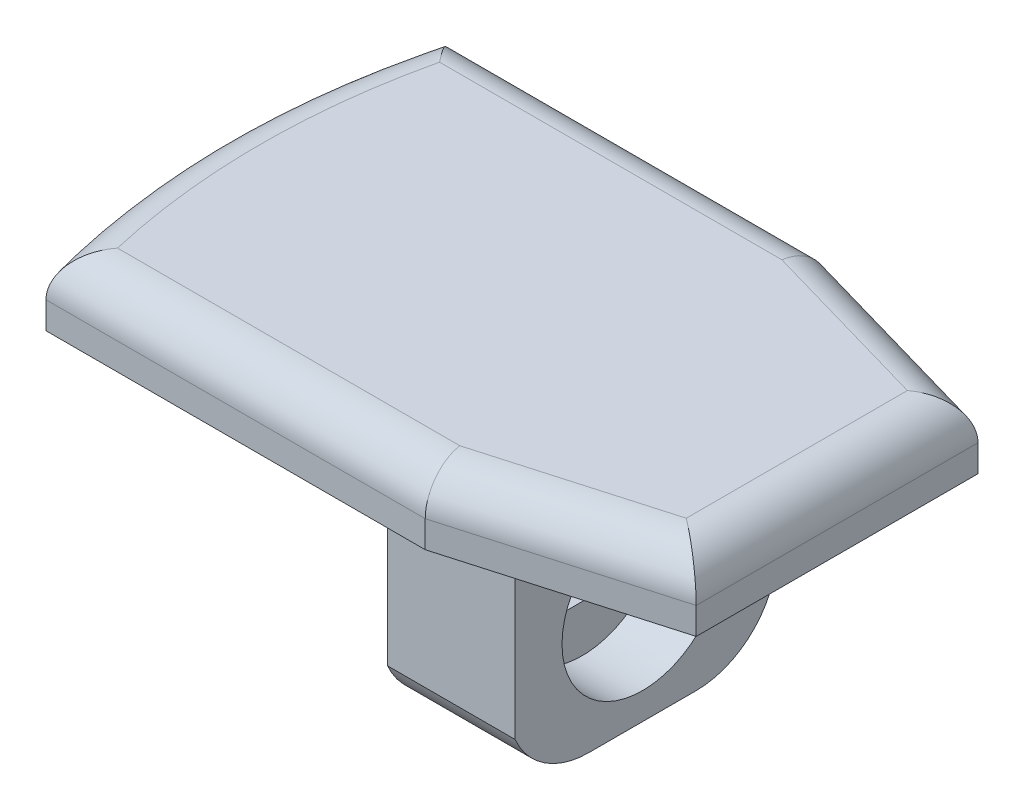
ISO-10303-21;
HEADER;
FILE_DESCRIPTION(('STEP AP214'),'2;1');
FILE_NAME('part.step','',(''),(''),'','','');
FILE_SCHEMA(('AUTOMOTIVE_DESIGN { 1 0 10303 214 1 1 1 1 }'));
ENDSEC;
DATA;
#1=APPLICATION_CONTEXT('core data for automotive mechanical design processes');
#2=APPLICATION_PROTOCOL_DEFINITION('international standard','automotive_design',2000,#1);
#3=PRODUCT_CONTEXT('',#1,'mechanical');
#4=PRODUCT('Part','Part','',(#3));
#5=PRODUCT_RELATED_PRODUCT_CATEGORY('part','',(#4));
#6=PRODUCT_DEFINITION_FORMATION('','',#4);
#7=PRODUCT_DEFINITION_CONTEXT('part definition',#1,'design');
#8=PRODUCT_DEFINITION('design','',#6,#7);
#9=PRODUCT_DEFINITION_SHAPE('','',#8);
#10=(LENGTH_UNIT() NAMED_UNIT(*) SI_UNIT(.MILLI.,.METRE.));
#11=(NAMED_UNIT(*) PLANE_ANGLE_UNIT() SI_UNIT($,.RADIAN.));
#12=(NAMED_UNIT(*) SI_UNIT($,.STERADIAN.) SOLID_ANGLE_UNIT());
#13=UNCERTAINTY_MEASURE_WITH_UNIT(LENGTH_MEASURE(1.E-05),#10,'distance_accuracy_value','');
#14=(GEOMETRIC_REPRESENTATION_CONTEXT(3) GLOBAL_UNCERTAINTY_ASSIGNED_CONTEXT((#13)) GLOBAL_UNIT_ASSIGNED_CONTEXT((#10,
#11,#12)) REPRESENTATION_CONTEXT('',''));
#15=CARTESIAN_POINT('',(0.,0.,0.));
#16=DIRECTION('',(0.,0.,1.));
#17=DIRECTION('',(1.,0.,0.));
#18=AXIS2_PLACEMENT_3D('',#15,#16,#17);
#19=CARTESIAN_POINT('',(0.,2.5,-50.6225865014302));
#20=DIRECTION('',(0.,0.,-1.));
#21=DIRECTION('',(-1.,0.,0.));
#22=AXIS2_PLACEMENT_3D('',#19,#20,#21);
#23=PLANE('',#22);
#24=DIRECTION('',(0.,-1.,0.));
#25=VECTOR('',#24,1.);
#26=CARTESIAN_POINT('',(-34.3395305183971,2.5,-50.6225865014302));
#27=LINE('',#26,#25);
#28=CARTESIAN_POINT('',(-34.3395305183971,1.,-50.6225865014302));
#29=VERTEX_POINT('',#28);
#30=CARTESIAN_POINT('',(-34.3395305183971,0.,-50.6225865014302));
#31=VERTEX_POINT('',#30);
#32=EDGE_CURVE('E288',#29,#31,#27,.T.);
#33=ORIENTED_EDGE('',*,*,#32,.F.);
#34=DIRECTION('',(1.,0.,0.));
#35=VECTOR('',#34,1.);
#36=CARTESIAN_POINT('',(0.,1.,-50.6225865014302));
#37=LINE('',#36,#35);
#38=CARTESIAN_POINT('',(-20.2093710966066,1.,-50.6225865014302));
#39=VERTEX_POINT('',#38);
#40=EDGE_CURVE('E314',#29,#39,#37,.T.);
#41=ORIENTED_EDGE('',*,*,#40,.T.);
#42=DIRECTION('',(0.,-1.,0.));
#43=VECTOR('',#42,1.);
#44=CARTESIAN_POINT('',(-20.2093710966066,2.5,-50.6225865014302));
#45=LINE('',#44,#43);
#46=CARTESIAN_POINT('',(-20.2093710966066,0.,-50.6225865014302));
#47=VERTEX_POINT('',#46);
#48=EDGE_CURVE('E278',#39,#47,#45,.T.);
#49=ORIENTED_EDGE('',*,*,#48,.T.);
#50=DIRECTION('',(1.,0.,0.));
#51=VECTOR('',#50,1.);
#52=CARTESIAN_POINT('',(0.,0.,-50.6225865014302));
#53=LINE('',#52,#51);
#54=EDGE_CURVE('E259',#31,#47,#53,.T.);
#55=ORIENTED_EDGE('',*,*,#54,.F.);
#56=EDGE_LOOP('',(#33,#41,#49,#55));
#57=FACE_BOUND('',#56,.T.);
#58=ADVANCED_FACE('F34',(#57),#23,.T.);
#59=CARTESIAN_POINT('',(-7.36268859796463,2.5,-43.1225865014302));
#60=DIRECTION('',(0.,-1.,0.));
#61=DIRECTION('',(0.,0.,-1.));
#62=AXIS2_PLACEMENT_3D('',#59,#60,#61);
#63=CYLINDRICAL_SURFACE('',#62,28.);
#64=DIRECTION('',(0.,-1.,0.));
#65=VECTOR('',#64,1.);
#66=CARTESIAN_POINT('',(-34.3395305183971,2.5,-35.6225865014302));
#67=LINE('',#66,#65);
#68=CARTESIAN_POINT('',(-34.3395305183971,1.,-35.6225865014302));
#69=VERTEX_POINT('',#68);
#70=CARTESIAN_POINT('',(-34.3395305183971,0.,-35.6225865014302));
#71=VERTEX_POINT('',#70);
#72=EDGE_CURVE('E286',#69,#71,#67,.T.);
#73=ORIENTED_EDGE('',*,*,#72,.F.);
#74=CARTESIAN_POINT('',(-7.36268859796463,1.,-43.1225865014302));
#75=DIRECTION('',(0.,1.,0.));
#76=DIRECTION('',(0.,0.,1.));
#77=AXIS2_PLACEMENT_3D('',#74,#75,#76);
#78=CIRCLE('',#77,28.);
#79=EDGE_CURVE('E312',#69,#29,#78,.F.);
#80=ORIENTED_EDGE('',*,*,#79,.T.);
#81=ORIENTED_EDGE('',*,*,#32,.T.);
#82=CARTESIAN_POINT('',(-7.36268859796463,0.,-43.1225865014302));
#83=DIRECTION('',(0.,1.,0.));
#84=DIRECTION('',(0.,0.,1.));
#85=AXIS2_PLACEMENT_3D('',#82,#83,#84);
#86=CIRCLE('',#85,28.);
#87=EDGE_CURVE('E262',#31,#71,#86,.T.);
#88=ORIENTED_EDGE('',*,*,#87,.T.);
#89=EDGE_LOOP('',(#73,#80,#81,#88));
#90=FACE_BOUND('',#89,.T.);
#91=ADVANCED_FACE('F370',(#90),#63,.T.);
#92=CARTESIAN_POINT('',(0.,2.5,-35.6225865014302));
#93=DIRECTION('',(0.,0.,1.));
#94=DIRECTION('',(1.,0.,0.));
#95=AXIS2_PLACEMENT_3D('',#92,#93,#94);
#96=PLANE('',#95);
#97=DIRECTION('',(0.,-1.,0.));
#98=VECTOR('',#97,1.);
#99=CARTESIAN_POINT('',(-20.2093710966067,2.5,-35.6225865014302));
#100=LINE('',#99,#98);
#101=CARTESIAN_POINT('',(-20.2093710966067,1.,-35.6225865014302));
#102=VERTEX_POINT('',#101);
#103=CARTESIAN_POINT('',(-20.2093710966067,0.,-35.6225865014302));
#104=VERTEX_POINT('',#103);
#105=EDGE_CURVE('E284',#102,#104,#100,.T.);
#106=ORIENTED_EDGE('',*,*,#105,.F.);
#107=DIRECTION('',(-1.,0.,0.));
#108=VECTOR('',#107,1.);
#109=CARTESIAN_POINT('',(0.,1.,-35.6225865014302));
#110=LINE('',#109,#108);
#111=EDGE_CURVE('E310',#102,#69,#110,.T.);
#112=ORIENTED_EDGE('',*,*,#111,.T.);
#113=ORIENTED_EDGE('',*,*,#72,.T.);
#114=DIRECTION('',(-1.,0.,0.));
#115=VECTOR('',#114,1.);
#116=CARTESIAN_POINT('',(0.,0.,-35.6225865014302));
#117=LINE('',#116,#115);
#118=EDGE_CURVE('E266',#104,#71,#117,.T.);
#119=ORIENTED_EDGE('',*,*,#118,.F.);
#120=EDGE_LOOP('',(#106,#112,#113,#119));
#121=FACE_BOUND('',#120,.T.);
#122=ADVANCED_FACE('F376',(#121),#96,.T.);
#123=CARTESIAN_POINT('',(-10.9739736212662,2.5,-38.2707941131326));
#124=DIRECTION('',(0.275637355817,0.,0.961261695938319));
#125=DIRECTION('',(0.961261695938319,0.,-0.275637355817));
#126=AXIS2_PLACEMENT_3D('',#123,#124,#125);
#127=PLANE('',#126);
#128=DIRECTION('',(0.,-1.,0.));
#129=VECTOR('',#128,1.);
#130=CARTESIAN_POINT('',(-12.3626885979646,2.5,-37.8725865014302));
#131=LINE('',#130,#129);
#132=CARTESIAN_POINT('',(-12.3626885979646,1.,-37.8725865014302));
#133=VERTEX_POINT('',#132);
#134=CARTESIAN_POINT('',(-12.3626885979646,0.,-37.8725865014302));
#135=VERTEX_POINT('',#134);
#136=EDGE_CURVE('E282',#133,#135,#131,.T.);
#137=ORIENTED_EDGE('',*,*,#136,.F.);
#138=DIRECTION('',(-0.961261695938319,0.,0.275637355817));
#139=VECTOR('',#138,1.);
#140=CARTESIAN_POINT('',(-10.9739736212662,1.,-38.2707941131326));
#141=LINE('',#140,#139);
#142=EDGE_CURVE('E308',#133,#102,#141,.T.);
#143=ORIENTED_EDGE('',*,*,#142,.T.);
#144=ORIENTED_EDGE('',*,*,#105,.T.);
#145=DIRECTION('',(-0.961261695938319,0.,0.275637355817));
#146=VECTOR('',#145,1.);
#147=CARTESIAN_POINT('',(-10.9739736212662,0.,-38.2707941131326));
#148=LINE('',#147,#146);
#149=EDGE_CURVE('E269',#135,#104,#148,.T.);
#150=ORIENTED_EDGE('',*,*,#149,.F.);
#151=EDGE_LOOP('',(#137,#143,#144,#150));
#152=FACE_BOUND('',#151,.T.);
#153=ADVANCED_FACE('F404',(#152),#127,.T.);
#154=CARTESIAN_POINT('',(-12.3626885979646,2.5,0.));
#155=DIRECTION('',(1.,0.,0.));
#156=DIRECTION('',(0.,0.,-1.));
#157=AXIS2_PLACEMENT_3D('',#154,#155,#156);
#158=PLANE('',#157);
#159=DIRECTION('',(0.,-1.,0.));
#160=VECTOR('',#159,1.);
#161=CARTESIAN_POINT('',(-12.3626885979646,2.5,-48.3725865014302));
#162=LINE('',#161,#160);
#163=CARTESIAN_POINT('',(-12.3626885979646,1.,-48.3725865014302));
#164=VERTEX_POINT('',#163);
#165=CARTESIAN_POINT('',(-12.3626885979646,0.,-48.3725865014302));
#166=VERTEX_POINT('',#165);
#167=EDGE_CURVE('E280',#164,#166,#162,.T.);
#168=ORIENTED_EDGE('',*,*,#167,.F.);
#169=DIRECTION('',(0.,0.,1.));
#170=VECTOR('',#169,1.);
#171=CARTESIAN_POINT('',(-12.3626885979646,1.,0.));
#172=LINE('',#171,#170);
#173=EDGE_CURVE('E306',#164,#133,#172,.T.);
#174=ORIENTED_EDGE('',*,*,#173,.T.);
#175=ORIENTED_EDGE('',*,*,#136,.T.);
#176=DIRECTION('',(0.,0.,1.));
#177=VECTOR('',#176,1.);
#178=CARTESIAN_POINT('',(-12.3626885979646,0.,0.));
#179=LINE('',#178,#177);
#180=EDGE_CURVE('E272',#166,#135,#179,.T.);
#181=ORIENTED_EDGE('',*,*,#180,.F.);
#182=EDGE_LOOP('',(#168,#174,#175,#181));
#183=FACE_BOUND('',#182,.T.);
#184=ADVANCED_FACE('F428',(#183),#158,.T.);
#185=CARTESIAN_POINT('',(11.8775156894045,2.5,-41.4218197721762));
#186=DIRECTION('',(0.275637355817001,0.,-0.961261695938319));
#187=DIRECTION('',(-0.961261695938319,0.,-0.275637355817001));
#188=AXIS2_PLACEMENT_3D('',#185,#186,#187);
#189=PLANE('',#188);
#190=ORIENTED_EDGE('',*,*,#48,.F.);
#191=DIRECTION('',(0.961261695938319,0.,0.275637355817001));
#192=VECTOR('',#191,1.);
#193=CARTESIAN_POINT('',(11.8775156894045,1.,-41.4218197721762));
#194=LINE('',#193,#192);
#195=EDGE_CURVE('E290',#39,#164,#194,.T.);
#196=ORIENTED_EDGE('',*,*,#195,.T.);
#197=ORIENTED_EDGE('',*,*,#167,.T.);
#198=DIRECTION('',(0.961261695938319,0.,0.275637355817001));
#199=VECTOR('',#198,1.);
#200=CARTESIAN_POINT('',(11.8775156894045,0.,-41.4218197721762));
#201=LINE('',#200,#199);
#202=EDGE_CURVE('E275',#47,#166,#201,.T.);
#203=ORIENTED_EDGE('',*,*,#202,.F.);
#204=EDGE_LOOP('',(#190,#196,#197,#203));
#205=FACE_BOUND('',#204,.T.);
#206=ADVANCED_FACE('F422',(#205),#189,.T.);
#207=CARTESIAN_POINT('',(0.,2.5,0.));
#208=DIRECTION('',(0.,1.,0.));
#209=DIRECTION('',(0.,0.,1.));
#210=AXIS2_PLACEMENT_3D('',#207,#208,#209);
#211=PLANE('',#210);
#212=DIRECTION('',(0.,0.,1.));
#213=VECTOR('',#212,1.);
#214=CARTESIAN_POINT('',(-13.8626885979646,2.5,0.));
#215=LINE('',#214,#213);
#216=CARTESIAN_POINT('',(-13.8626885979646,2.5,-39.0029175765844));
#217=VERTEX_POINT('',#216);
#218=CARTESIAN_POINT('',(-13.8626885979646,2.5,-47.242255426276));
#219=VERTEX_POINT('',#218);
#220=EDGE_CURVE('E301',#217,#219,#215,.F.);
#221=ORIENTED_EDGE('',*,*,#220,.T.);
#222=DIRECTION('',(0.961261695938319,0.,0.275637355817001));
#223=VECTOR('',#222,1.);
#224=CARTESIAN_POINT('',(11.464059655679,2.5,-39.9799272282687));
#225=LINE('',#224,#223);
#226=CARTESIAN_POINT('',(-20.4201823486602,2.5,-49.1225865014302));
#227=VERTEX_POINT('',#226);
#228=EDGE_CURVE('E303',#219,#227,#225,.F.);
#229=ORIENTED_EDGE('',*,*,#228,.T.);
#230=DIRECTION('',(1.,0.,0.));
#231=VECTOR('',#230,1.);
#232=CARTESIAN_POINT('',(0.,2.5,-49.1225865014302));
#233=LINE('',#232,#231);
#234=CARTESIAN_POINT('',(-33.1745075962452,2.5,-49.1225865014302));
#235=VERTEX_POINT('',#234);
#236=EDGE_CURVE('E293',#227,#235,#233,.F.);
#237=ORIENTED_EDGE('',*,*,#236,.T.);
#238=CARTESIAN_POINT('',(-7.36268859796463,2.5,-43.1225865014302));
#239=DIRECTION('',(0.,1.,0.));
#240=DIRECTION('',(0.,0.,1.));
#241=AXIS2_PLACEMENT_3D('',#238,#239,#240);
#242=CIRCLE('',#241,26.5);
#243=CARTESIAN_POINT('',(-33.1745075962452,2.5,-37.1225865014302));
#244=VERTEX_POINT('',#243);
#245=EDGE_CURVE('E295',#235,#244,#242,.T.);
#246=ORIENTED_EDGE('',*,*,#245,.T.);
#247=DIRECTION('',(-1.,0.,0.));
#248=VECTOR('',#247,1.);
#249=CARTESIAN_POINT('',(0.,2.5,-37.1225865014302));
#250=LINE('',#249,#248);
#251=CARTESIAN_POINT('',(-20.4201823486603,2.5,-37.1225865014302));
#252=VERTEX_POINT('',#251);
#253=EDGE_CURVE('E297',#244,#252,#250,.F.);
#254=ORIENTED_EDGE('',*,*,#253,.T.);
#255=DIRECTION('',(-0.961261695938319,0.,0.275637355817));
#256=VECTOR('',#255,1.);
#257=CARTESIAN_POINT('',(-11.3874296549917,2.5,-39.7126866570401));
#258=LINE('',#257,#256);
#259=EDGE_CURVE('E299',#252,#217,#258,.F.);
#260=ORIENTED_EDGE('',*,*,#259,.T.);
#261=EDGE_LOOP('',(#221,#229,#237,#246,#254,#260));
#262=FACE_BOUND('',#261,.T.);
#263=ADVANCED_FACE('F435',(#262),#211,.T.);
#264=CARTESIAN_POINT('',(0.,0.,0.));
#265=DIRECTION('',(0.,1.,0.));
#266=DIRECTION('',(0.,0.,1.));
#267=AXIS2_PLACEMENT_3D('',#264,#265,#266);
#268=PLANE('',#267);
#269=ORIENTED_EDGE('',*,*,#54,.T.);
#270=ORIENTED_EDGE('',*,*,#202,.T.);
#271=ORIENTED_EDGE('',*,*,#180,.T.);
#272=ORIENTED_EDGE('',*,*,#149,.T.);
#273=ORIENTED_EDGE('',*,*,#118,.T.);
#274=ORIENTED_EDGE('',*,*,#87,.F.);
#275=EDGE_LOOP('',(#269,#270,#271,#272,#273,#274));
#276=FACE_BOUND('',#275,.T.);
#277=CARTESIAN_POINT('',(-7.36268859796443,0.,-43.1225865014302));
#278=DIRECTION('',(0.,-1.,0.));
#279=DIRECTION('',(0.,0.,1.));
#280=AXIS2_PLACEMENT_3D('',#277,#278,#279);
#281=CIRCLE('',#280,25.7500000000002);
#282=CARTESIAN_POINT('',(-32.6707900676522,0.,-38.3725865014302));
#283=VERTEX_POINT('',#282);
#284=CARTESIAN_POINT('',(-32.6707900676522,0.,-47.8725865014302));
#285=VERTEX_POINT('',#284);
#286=EDGE_CURVE('E207',#283,#285,#281,.T.);
#287=ORIENTED_EDGE('',*,*,#286,.F.);
#288=DIRECTION('',(-1.,0.,0.));
#289=VECTOR('',#288,1.);
#290=CARTESIAN_POINT('',(-19.6126885979646,0.,-38.3725865014302));
#291=LINE('',#290,#289);
#292=CARTESIAN_POINT('',(-19.6126885979646,0.,-38.3725865014302));
#293=VERTEX_POINT('',#292);
#294=EDGE_CURVE('E199',#293,#283,#291,.T.);
#295=ORIENTED_EDGE('',*,*,#294,.F.);
#296=DIRECTION('',(0.,0.,1.));
#297=VECTOR('',#296,1.);
#298=CARTESIAN_POINT('',(-19.6126885979646,0.,-47.8725865014302));
#299=LINE('',#298,#297);
#300=CARTESIAN_POINT('',(-19.6126885979646,0.,-47.8725865014302));
#301=VERTEX_POINT('',#300);
#302=EDGE_CURVE('E183',#301,#293,#299,.T.);
#303=ORIENTED_EDGE('',*,*,#302,.F.);
#304=DIRECTION('',(1.,0.,0.));
#305=VECTOR('',#304,1.);
#306=CARTESIAN_POINT('',(-19.6126885979646,0.,-47.8725865014302));
#307=LINE('',#306,#305);
#308=EDGE_CURVE('E196',#285,#301,#307,.T.);
#309=ORIENTED_EDGE('',*,*,#308,.F.);
#310=EDGE_LOOP('',(#287,#295,#303,#309));
#311=FACE_BOUND('',#310,.T.);
#312=ADVANCED_FACE('F195',(#276,#311),#268,.F.);
#313=CARTESIAN_POINT('',(0.,1.,-37.1225865014302));
#314=DIRECTION('',(-1.,0.,0.));
#315=DIRECTION('',(0.,0.,1.));
#316=AXIS2_PLACEMENT_3D('',#313,#314,#315);
#317=CYLINDRICAL_SURFACE('',#316,1.5);
#318=CARTESIAN_POINT('',(-20.4201823486602,1.,-37.1225865014302));
#319=DIRECTION('',(-0.99026806874157,0.,0.139173100960066));
#320=DIRECTION('',(-0.139173100960065,0.,-0.990268068741571));
#321=AXIS2_PLACEMENT_3D('',#318,#319,#320);
#322=ELLIPSE('',#321,1.51474135877793,1.5);
#323=EDGE_CURVE('E331',#252,#102,#322,.F.);
#324=ORIENTED_EDGE('',*,*,#323,.F.);
#325=ORIENTED_EDGE('',*,*,#253,.F.);
#326=CARTESIAN_POINT('',(-34.3395305183971,1.,-35.6225865014302));
#327=CARTESIAN_POINT('',(-34.3395328536621,1.03608039633348,-35.6225831912668));
#328=CARTESIAN_POINT('',(-34.3385404683693,1.07214073475895,-35.6238893730918));
#329=CARTESIAN_POINT('',(-34.3345984808231,1.14395069350024,-35.629076334847));
#330=CARTESIAN_POINT('',(-34.3316498387002,1.17970045753022,-35.6329558517845));
#331=CARTESIAN_POINT('',(-34.319969056972,1.28565336330926,-35.6483204930772));
#332=CARTESIAN_POINT('',(-34.3084010639559,1.35505300951268,-35.6635330711589));
#333=CARTESIAN_POINT('',(-34.2783868681752,1.48946757320146,-35.7029622916945));
#334=CARTESIAN_POINT('',(-34.2599513826133,1.5544891372799,-35.7271649044028));
#335=CARTESIAN_POINT('',(-34.217104665054,1.6790332073116,-35.7833376181721));
#336=CARTESIAN_POINT('',(-34.1926856984093,1.73854845715303,-35.815317772599));
#337=CARTESIAN_POINT('',(-34.1369878809526,1.85509812562639,-35.8881407477034));
#338=CARTESIAN_POINT('',(-34.1053485798,1.91166753970272,-35.929447139332));
#339=CARTESIAN_POINT('',(-34.0375150597707,2.01697248513691,-36.0178251568492));
#340=CARTESIAN_POINT('',(-34.0013197309525,2.06570610092307,-36.0648981875339));
#341=CARTESIAN_POINT('',(-33.917993242335,2.16389046813266,-36.173021751085));
#342=CARTESIAN_POINT('',(-33.8701012483687,2.21165520298172,-36.2350143903203));
#343=CARTESIAN_POINT('',(-33.7705728945552,2.29601487337483,-36.3634677470013));
#344=CARTESIAN_POINT('',(-33.718932450196,2.33259739103286,-36.429933332484));
#345=CARTESIAN_POINT('',(-33.601806604551,2.40144117104505,-36.5802156979388));
#346=CARTESIAN_POINT('',(-33.5357063948009,2.4311436552944,-36.6647245167518));
#347=CARTESIAN_POINT('',(-33.4013440779191,2.47497769745559,-36.8358286525521));
#348=CARTESIAN_POINT('',(-33.3330847051392,2.48912819737013,-36.922421299755));
#349=CARTESIAN_POINT('',(-33.236138250163,2.49841641038692,-37.0449135449037));
#350=CARTESIAN_POINT('',(-33.207778480836,2.4998409322229,-37.0806873575064));
#351=CARTESIAN_POINT('',(-33.1777616500822,2.49999580166227,-37.118489085609));
#352=CARTESIAN_POINT('',(-33.1761346692557,2.49999999852218,-37.120537832223));
#353=CARTESIAN_POINT('',(-33.1745075962452,2.5,-37.1225865014302));
#354=B_SPLINE_CURVE_WITH_KNOTS('',3,(#326,#327,#328,#329,#330,#331,#332,#333,#334,#335,#336,
#337,#338,#339,#340,#341,#342,#343,#344,#345,#346,#347,#348,#349,#350,#351,#352,#353),
.UNSPECIFIED.,.F.,.F.,(4,2,2,2,2,2,2,2,2,2,2,2,2,4),(0.,0.108165320883747,0.216277593476679,
0.431044770958129,0.645478183814628,0.860190263630719,1.08992666101489,1.31971913559943,
1.59397754445659,1.86853942079571,2.20128774687989,2.53363034153708,2.67059182436621,
2.67844038135514),.UNSPECIFIED.);
#355=EDGE_CURVE('E263',#69,#244,#354,.T.);
#356=ORIENTED_EDGE('',*,*,#355,.F.);
#357=ORIENTED_EDGE('',*,*,#111,.F.);
#358=EDGE_LOOP('',(#324,#325,#356,#357));
#359=FACE_BOUND('',#358,.T.);
#360=ADVANCED_FACE('F341',(#359),#317,.T.);
#361=CARTESIAN_POINT('',(-7.36268859796463,1.,-43.1225865014302));
#362=DIRECTION('',(0.,1.,0.));
#363=DIRECTION('',(0.,0.,1.));
#364=AXIS2_PLACEMENT_3D('',#361,#362,#363);
#365=TOROIDAL_SURFACE('',#364,26.5,1.5);
#366=ORIENTED_EDGE('',*,*,#355,.T.);
#367=ORIENTED_EDGE('',*,*,#245,.F.);
#368=CARTESIAN_POINT('',(-34.3395305183971,1.,-50.6225865014302));
#369=CARTESIAN_POINT('',(-34.3395328536621,1.03608039633348,-50.6225898115936));
#370=CARTESIAN_POINT('',(-34.3385404683693,1.07214073475895,-50.6212836297686));
#371=CARTESIAN_POINT('',(-34.3345984808231,1.14395069350024,-50.6160966680133));
#372=CARTESIAN_POINT('',(-34.3316498387002,1.17970045753022,-50.6122171510758));
#373=CARTESIAN_POINT('',(-34.319969056972,1.28565336330926,-50.5968525097832));
#374=CARTESIAN_POINT('',(-34.3084010639559,1.35505300951268,-50.5816399317015));
#375=CARTESIAN_POINT('',(-34.2783868681752,1.48946757320146,-50.5422107111658));
#376=CARTESIAN_POINT('',(-34.2599513826133,1.5544891372799,-50.5180080984575));
#377=CARTESIAN_POINT('',(-34.217104665054,1.6790332073116,-50.4618353846883));
#378=CARTESIAN_POINT('',(-34.1926856984093,1.73854845715303,-50.4298552302614));
#379=CARTESIAN_POINT('',(-34.1369878809526,1.85509812562639,-50.357032255157));
#380=CARTESIAN_POINT('',(-34.1053485798,1.91166753970272,-50.3157258635284));
#381=CARTESIAN_POINT('',(-34.0375150597707,2.01697248513691,-50.2273478460112));
#382=CARTESIAN_POINT('',(-34.0013197309525,2.06570610092307,-50.1802748153265));
#383=CARTESIAN_POINT('',(-33.917993242335,2.16389046813266,-50.0721512517754));
#384=CARTESIAN_POINT('',(-33.8701012483687,2.21165520298172,-50.0101586125401));
#385=CARTESIAN_POINT('',(-33.7705728945552,2.29601487337483,-49.8817052558591));
#386=CARTESIAN_POINT('',(-33.718932450196,2.33259739103286,-49.8152396703764));
#387=CARTESIAN_POINT('',(-33.601806604551,2.40144117104505,-49.6649573049216));
#388=CARTESIAN_POINT('',(-33.5357063948009,2.4311436552944,-49.5804484861086));
#389=CARTESIAN_POINT('',(-33.4013440779191,2.47497769745559,-49.4093443503083));
#390=CARTESIAN_POINT('',(-33.3330847051392,2.48912819737013,-49.3227517031054));
#391=CARTESIAN_POINT('',(-33.236138250163,2.49841641038692,-49.2002594579567));
#392=CARTESIAN_POINT('',(-33.207778480836,2.4998409322229,-49.164485645354));
#393=CARTESIAN_POINT('',(-33.1777616500822,2.49999580166227,-49.1266839172514));
#394=CARTESIAN_POINT('',(-33.1761346692557,2.49999999852218,-49.1246351706373));
#395=CARTESIAN_POINT('',(-33.1745075962452,2.5,-49.1225865014302));
#396=B_SPLINE_CURVE_WITH_KNOTS('',3,(#368,#369,#370,#371,#372,#373,#374,#375,#376,#377,#378,
#379,#380,#381,#382,#383,#384,#385,#386,#387,#388,#389,#390,#391,#392,#393,#394,#395),
.UNSPECIFIED.,.F.,.F.,(4,2,2,2,2,2,2,2,2,2,2,2,2,4),(0.,0.108165320883747,0.216277593476679,
0.431044770958129,0.645478183814628,0.860190263630719,1.08992666101489,1.31971913559943,
1.59397754445659,1.86853942079571,2.20128774687989,2.53363034153708,2.67059182436621,
2.67844038135514),.UNSPECIFIED.);
#397=EDGE_CURVE('E323',#29,#235,#396,.T.);
#398=ORIENTED_EDGE('',*,*,#397,.F.);
#399=ORIENTED_EDGE('',*,*,#79,.F.);
#400=EDGE_LOOP('',(#366,#367,#398,#399));
#401=FACE_BOUND('',#400,.T.);
#402=ADVANCED_FACE('F336',(#401),#365,.T.);
#403=CARTESIAN_POINT('',(-11.3874296549917,1.,-39.7126866570401));
#404=DIRECTION('',(-0.961261695938319,0.,0.275637355817));
#405=DIRECTION('',(0.275637355817,0.,0.961261695938319));
#406=AXIS2_PLACEMENT_3D('',#403,#404,#405);
#407=CYLINDRICAL_SURFACE('',#406,1.5);
#408=ORIENTED_EDGE('',*,*,#323,.T.);
#409=ORIENTED_EDGE('',*,*,#142,.F.);
#410=CARTESIAN_POINT('',(-13.8626885979646,1.,-39.0029175765844));
#411=DIRECTION('',(-0.601815023152048,0.,0.798635510047293));
#412=DIRECTION('',(-0.798635510047293,0.,-0.601815023152048));
#413=AXIS2_PLACEMENT_3D('',#410,#411,#412);
#414=ELLIPSE('',#413,1.87820348723434,1.5);
#415=EDGE_CURVE('E320',#217,#133,#414,.F.);
#416=ORIENTED_EDGE('',*,*,#415,.F.);
#417=ORIENTED_EDGE('',*,*,#259,.F.);
#418=EDGE_LOOP('',(#408,#409,#416,#417));
#419=FACE_BOUND('',#418,.T.);
#420=ADVANCED_FACE('F340',(#419),#407,.T.);
#421=CARTESIAN_POINT('',(0.,1.,-49.1225865014302));
#422=DIRECTION('',(1.,0.,0.));
#423=DIRECTION('',(0.,0.,-1.));
#424=AXIS2_PLACEMENT_3D('',#421,#422,#423);
#425=CYLINDRICAL_SURFACE('',#424,1.5);
#426=ORIENTED_EDGE('',*,*,#397,.T.);
#427=ORIENTED_EDGE('',*,*,#236,.F.);
#428=CARTESIAN_POINT('',(-20.4201823486602,1.,-49.1225865014302));
#429=DIRECTION('',(0.99026806874157,0.,0.139173100960066));
#430=DIRECTION('',(0.139173100960066,0.,-0.99026806874157));
#431=AXIS2_PLACEMENT_3D('',#428,#429,#430);
#432=ELLIPSE('',#431,1.51474135877793,1.5);
#433=EDGE_CURVE('E318',#39,#227,#432,.T.);
#434=ORIENTED_EDGE('',*,*,#433,.F.);
#435=ORIENTED_EDGE('',*,*,#40,.F.);
#436=EDGE_LOOP('',(#426,#427,#434,#435));
#437=FACE_BOUND('',#436,.T.);
#438=ADVANCED_FACE('F333',(#437),#425,.T.);
#439=CARTESIAN_POINT('',(-13.8626885979646,1.,0.));
#440=DIRECTION('',(0.,0.,1.));
#441=DIRECTION('',(1.,0.,0.));
#442=AXIS2_PLACEMENT_3D('',#439,#440,#441);
#443=CYLINDRICAL_SURFACE('',#442,1.5);
#444=ORIENTED_EDGE('',*,*,#415,.T.);
#445=ORIENTED_EDGE('',*,*,#173,.F.);
#446=CARTESIAN_POINT('',(-13.8626885979646,1.,-47.242255426276));
#447=DIRECTION('',(0.601815023152048,0.,0.798635510047293));
#448=DIRECTION('',(-0.798635510047293,0.,0.601815023152048));
#449=AXIS2_PLACEMENT_3D('',#446,#447,#448);
#450=ELLIPSE('',#449,1.87820348723434,1.5);
#451=EDGE_CURVE('E256',#219,#164,#450,.F.);
#452=ORIENTED_EDGE('',*,*,#451,.F.);
#453=ORIENTED_EDGE('',*,*,#220,.F.);
#454=EDGE_LOOP('',(#444,#445,#452,#453));
#455=FACE_BOUND('',#454,.T.);
#456=ADVANCED_FACE('F384',(#455),#443,.T.);
#457=CARTESIAN_POINT('',(11.464059655679,1.,-39.9799272282687));
#458=DIRECTION('',(0.961261695938319,0.,0.275637355817001));
#459=DIRECTION('',(0.275637355817001,0.,-0.961261695938319));
#460=AXIS2_PLACEMENT_3D('',#457,#458,#459);
#461=CYLINDRICAL_SURFACE('',#460,1.5);
#462=ORIENTED_EDGE('',*,*,#433,.T.);
#463=ORIENTED_EDGE('',*,*,#228,.F.);
#464=ORIENTED_EDGE('',*,*,#451,.T.);
#465=ORIENTED_EDGE('',*,*,#195,.F.);
#466=EDGE_LOOP('',(#462,#463,#464,#465));
#467=FACE_BOUND('',#466,.T.);
#468=ADVANCED_FACE('F382',(#467),#461,.T.);
#469=CARTESIAN_POINT('',(-19.6126885979646,-10.,-47.8725865014302));
#470=DIRECTION('',(-1.,0.,0.));
#471=DIRECTION('',(0.,0.,1.));
#472=AXIS2_PLACEMENT_3D('',#469,#470,#471);
#473=PLANE('',#472);
#474=CARTESIAN_POINT('',(-19.6126885979646,-6.,-45.1225865014302));
#475=DIRECTION('',(-1.,0.,0.));
#476=DIRECTION('',(0.,0.,1.));
#477=AXIS2_PLACEMENT_3D('',#474,#475,#476);
#478=CIRCLE('',#477,3.);
#479=CARTESIAN_POINT('',(-19.6126885979646,-9.,-45.1225865014302));
#480=VERTEX_POINT('',#479);
#481=CARTESIAN_POINT('',(-19.6126885979646,-7.19895788082817,-47.8725865014302));
#482=VERTEX_POINT('',#481);
#483=EDGE_CURVE('E185',#480,#482,#478,.F.);
#484=ORIENTED_EDGE('',*,*,#483,.T.);
#485=DIRECTION('',(0.,1.,0.));
#486=VECTOR('',#485,1.);
#487=CARTESIAN_POINT('',(-19.6126885979646,-10.,-47.8725865014302));
#488=LINE('',#487,#486);
#489=EDGE_CURVE('E178',#482,#301,#488,.T.);
#490=ORIENTED_EDGE('',*,*,#489,.T.);
#491=ORIENTED_EDGE('',*,*,#302,.T.);
#492=DIRECTION('',(0.,1.,0.));
#493=VECTOR('',#492,1.);
#494=CARTESIAN_POINT('',(-19.6126885979646,-10.,-38.3725865014302));
#495=LINE('',#494,#493);
#496=CARTESIAN_POINT('',(-19.6126885979646,-7.19895788082817,-38.3725865014302));
#497=VERTEX_POINT('',#496);
#498=EDGE_CURVE('E189',#497,#293,#495,.T.);
#499=ORIENTED_EDGE('',*,*,#498,.F.);
#500=CARTESIAN_POINT('',(-19.6126885979646,-6.,-41.1225865014302));
#501=DIRECTION('',(-1.,0.,0.));
#502=DIRECTION('',(0.,0.,1.));
#503=AXIS2_PLACEMENT_3D('',#500,#501,#502);
#504=CIRCLE('',#503,3.);
#505=CARTESIAN_POINT('',(-19.6126885979646,-9.,-41.1225865014302));
#506=VERTEX_POINT('',#505);
#507=EDGE_CURVE('E624',#497,#506,#504,.F.);
#508=ORIENTED_EDGE('',*,*,#507,.T.);
#509=DIRECTION('',(0.,0.,-1.));
#510=VECTOR('',#509,1.);
#511=CARTESIAN_POINT('',(-19.6126885979646,-9.,0.));
#512=LINE('',#511,#510);
#513=EDGE_CURVE('E216',#506,#480,#512,.T.);
#514=ORIENTED_EDGE('',*,*,#513,.T.);
#515=EDGE_LOOP('',(#484,#490,#491,#499,#508,#514));
#516=FACE_BOUND('',#515,.T.);
#517=CARTESIAN_POINT('',(-19.6126885979646,-5.,-43.1225865014302));
#518=DIRECTION('',(-1.,0.,0.));
#519=DIRECTION('',(0.,0.,1.));
#520=AXIS2_PLACEMENT_3D('',#517,#518,#519);
#521=CIRCLE('',#520,3.);
#522=CARTESIAN_POINT('',(-19.6126885979646,-5.,-40.1225865014302));
#523=VERTEX_POINT('',#522);
#524=EDGE_CURVE('E219',#523,#523,#521,.F.);
#525=ORIENTED_EDGE('',*,*,#524,.F.);
#526=EDGE_LOOP('',(#525));
#527=FACE_BOUND('',#526,.T.);
#528=ADVANCED_FACE('F180',(#516,#527),#473,.F.);
#529=CARTESIAN_POINT('',(-19.6126885979646,-10.,-47.8725865014302));
#530=DIRECTION('',(0.,0.,1.));
#531=DIRECTION('',(1.,0.,0.));
#532=AXIS2_PLACEMENT_3D('',#529,#530,#531);
#533=PLANE('',#532);
#534=DIRECTION('',(-1.,0.,0.));
#535=VECTOR('',#534,1.);
#536=CARTESIAN_POINT('',(0.,-1.5,-47.8725865014302));
#537=LINE('',#536,#535);
#538=CARTESIAN_POINT('',(-24.3626885979646,-1.5,-47.8725865014302));
#539=VERTEX_POINT('',#538);
#540=CARTESIAN_POINT('',(-32.6707900676522,-1.5,-47.8725865014302));
#541=VERTEX_POINT('',#540);
#542=EDGE_CURVE('E224',#539,#541,#537,.T.);
#543=ORIENTED_EDGE('',*,*,#542,.T.);
#544=DIRECTION('',(0.,1.,0.));
#545=VECTOR('',#544,1.);
#546=CARTESIAN_POINT('',(-32.6707900676522,-10.,-47.8725865014302));
#547=LINE('',#546,#545);
#548=EDGE_CURVE('E203',#541,#285,#547,.T.);
#549=ORIENTED_EDGE('',*,*,#548,.T.);
#550=ORIENTED_EDGE('',*,*,#308,.T.);
#551=ORIENTED_EDGE('',*,*,#489,.F.);
#552=DIRECTION('',(-1.,0.,0.));
#553=VECTOR('',#552,1.);
#554=CARTESIAN_POINT('',(0.,-7.19895788082816,-47.8725865014302));
#555=LINE('',#554,#553);
#556=CARTESIAN_POINT('',(-24.3626885979646,-7.19895788082816,-47.8725865014302));
#557=VERTEX_POINT('',#556);
#558=EDGE_CURVE('E42',#482,#557,#555,.T.);
#559=ORIENTED_EDGE('',*,*,#558,.T.);
#560=DIRECTION('',(0.,-1.,0.));
#561=VECTOR('',#560,1.);
#562=CARTESIAN_POINT('',(-24.3626885979646,-9.,-47.8725865014302));
#563=LINE('',#562,#561);
#564=EDGE_CURVE('E222',#539,#557,#563,.T.);
#565=ORIENTED_EDGE('',*,*,#564,.F.);
#566=EDGE_LOOP('',(#543,#549,#550,#551,#559,#565));
#567=FACE_BOUND('',#566,.T.);
#568=ADVANCED_FACE('F201',(#567),#533,.F.);
#569=CARTESIAN_POINT('',(-19.6126885979646,-10.,-38.3725865014302));
#570=DIRECTION('',(0.,0.,-1.));
#571=DIRECTION('',(-1.,0.,0.));
#572=AXIS2_PLACEMENT_3D('',#569,#570,#571);
#573=PLANE('',#572);
#574=DIRECTION('',(1.,0.,0.));
#575=VECTOR('',#574,1.);
#576=CARTESIAN_POINT('',(0.,-1.5,-38.3725865014302));
#577=LINE('',#576,#575);
#578=CARTESIAN_POINT('',(-32.6707900676522,-1.5,-38.3725865014302));
#579=VERTEX_POINT('',#578);
#580=CARTESIAN_POINT('',(-24.3626885979646,-1.5,-38.3725865014302));
#581=VERTEX_POINT('',#580);
#582=EDGE_CURVE('E214',#579,#581,#577,.T.);
#583=ORIENTED_EDGE('',*,*,#582,.T.);
#584=DIRECTION('',(0.,1.,0.));
#585=VECTOR('',#584,1.);
#586=CARTESIAN_POINT('',(-24.3626885979646,-9.,-38.3725865014302));
#587=LINE('',#586,#585);
#588=CARTESIAN_POINT('',(-24.3626885979646,-7.19895788082817,-38.3725865014302));
#589=VERTEX_POINT('',#588);
#590=EDGE_CURVE('E49',#589,#581,#587,.T.);
#591=ORIENTED_EDGE('',*,*,#590,.F.);
#592=DIRECTION('',(1.,0.,0.));
#593=VECTOR('',#592,1.);
#594=CARTESIAN_POINT('',(0.,-7.19895788082817,-38.3725865014302));
#595=LINE('',#594,#593);
#596=EDGE_CURVE('E619',#589,#497,#595,.T.);
#597=ORIENTED_EDGE('',*,*,#596,.T.);
#598=ORIENTED_EDGE('',*,*,#498,.T.);
#599=ORIENTED_EDGE('',*,*,#294,.T.);
#600=DIRECTION('',(0.,1.,0.));
#601=VECTOR('',#600,1.);
#602=CARTESIAN_POINT('',(-32.6707900676522,-10.,-38.3725865014302));
#603=LINE('',#602,#601);
#604=EDGE_CURVE('E210',#579,#283,#603,.T.);
#605=ORIENTED_EDGE('',*,*,#604,.F.);
#606=EDGE_LOOP('',(#583,#591,#597,#598,#599,#605));
#607=FACE_BOUND('',#606,.T.);
#608=ADVANCED_FACE('F573',(#607),#573,.F.);
#609=CARTESIAN_POINT('',(-7.36268859796443,-10.,-43.1225865014302));
#610=DIRECTION('',(0.,1.,0.));
#611=DIRECTION('',(0.,0.,1.));
#612=AXIS2_PLACEMENT_3D('',#609,#610,#611);
#613=CYLINDRICAL_SURFACE('',#612,25.7500000000002);
#614=CARTESIAN_POINT('',(-7.36268859796443,-1.5,-43.1225865014302));
#615=DIRECTION('',(0.,-1.,0.));
#616=DIRECTION('',(0.,0.,-1.));
#617=AXIS2_PLACEMENT_3D('',#614,#615,#616);
#618=CIRCLE('',#617,25.7500000000002);
#619=EDGE_CURVE('E11',#541,#579,#618,.F.);
#620=ORIENTED_EDGE('',*,*,#619,.T.);
#621=ORIENTED_EDGE('',*,*,#604,.T.);
#622=ORIENTED_EDGE('',*,*,#286,.T.);
#623=ORIENTED_EDGE('',*,*,#548,.F.);
#624=EDGE_LOOP('',(#620,#621,#622,#623));
#625=FACE_BOUND('',#624,.T.);
#626=ADVANCED_FACE('F525',(#625),#613,.T.);
#627=CARTESIAN_POINT('',(-21.8626885979646,-5.,-43.1225865014302));
#628=DIRECTION('',(1.,0.,0.));
#629=DIRECTION('',(0.,0.,-1.));
#630=AXIS2_PLACEMENT_3D('',#627,#628,#629);
#631=PLANE('',#630);
#632=DIRECTION('',(0.,0.,-1.));
#633=VECTOR('',#632,1.);
#634=CARTESIAN_POINT('',(-21.8626885979646,-6.25,0.));
#635=LINE('',#634,#633);
#636=CARTESIAN_POINT('',(-21.8626885979646,-6.25,-40.3954084727713));
#637=VERTEX_POINT('',#636);
#638=CARTESIAN_POINT('',(-21.8626885979646,-6.25,-45.8497645300891));
#639=VERTEX_POINT('',#638);
#640=EDGE_CURVE('E226',#637,#639,#635,.T.);
#641=ORIENTED_EDGE('',*,*,#640,.F.);
#642=CARTESIAN_POINT('',(-21.8626885979646,-5.,-43.1225865014302));
#643=DIRECTION('',(1.,0.,0.));
#644=DIRECTION('',(0.,0.,-1.));
#645=AXIS2_PLACEMENT_3D('',#642,#643,#644);
#646=CIRCLE('',#645,3.);
#647=EDGE_CURVE('E244',#637,#639,#646,.T.);
#648=ORIENTED_EDGE('',*,*,#647,.T.);
#649=EDGE_LOOP('',(#641,#648));
#650=FACE_BOUND('',#649,.T.);
#651=ADVANCED_FACE('F368',(#650),#631,.T.);
#652=CARTESIAN_POINT('',(-24.3626885979646,-6.25,0.));
#653=DIRECTION('',(0.,-1.,0.));
#654=DIRECTION('',(0.,0.,-1.));
#655=AXIS2_PLACEMENT_3D('',#652,#653,#654);
#656=PLANE('',#655);
#657=ORIENTED_EDGE('',*,*,#640,.T.);
#658=DIRECTION('',(1.,0.,0.));
#659=VECTOR('',#658,1.);
#660=CARTESIAN_POINT('',(-24.3626885979646,-6.25,-45.8497645300891));
#661=LINE('',#660,#659);
#662=CARTESIAN_POINT('',(-24.3626885979646,-6.25,-45.8497645300891));
#663=VERTEX_POINT('',#662);
#664=EDGE_CURVE('E247',#663,#639,#661,.T.);
#665=ORIENTED_EDGE('',*,*,#664,.F.);
#666=DIRECTION('',(0.,0.,-1.));
#667=VECTOR('',#666,1.);
#668=CARTESIAN_POINT('',(-24.3626885979646,-6.25,0.));
#669=LINE('',#668,#667);
#670=CARTESIAN_POINT('',(-24.3626885979646,-6.25,-40.3954084727713));
#671=VERTEX_POINT('',#670);
#672=EDGE_CURVE('E230',#671,#663,#669,.T.);
#673=ORIENTED_EDGE('',*,*,#672,.F.);
#674=DIRECTION('',(1.,0.,0.));
#675=VECTOR('',#674,1.);
#676=CARTESIAN_POINT('',(-24.3626885979646,-6.25,-40.3954084727713));
#677=LINE('',#676,#675);
#678=EDGE_CURVE('E237',#671,#637,#677,.T.);
#679=ORIENTED_EDGE('',*,*,#678,.T.);
#680=EDGE_LOOP('',(#657,#665,#673,#679));
#681=FACE_BOUND('',#680,.T.);
#682=ADVANCED_FACE('F524',(#681),#656,.F.);
#683=CARTESIAN_POINT('',(-24.3626885979646,-3.75,0.));
#684=DIRECTION('',(0.,-1.,0.));
#685=DIRECTION('',(0.,0.,-1.));
#686=AXIS2_PLACEMENT_3D('',#683,#684,#685);
#687=PLANE('',#686);
#688=DIRECTION('',(0.,0.,-1.));
#689=VECTOR('',#688,1.);
#690=CARTESIAN_POINT('',(-21.8626885979646,-3.75,0.));
#691=LINE('',#690,#689);
#692=CARTESIAN_POINT('',(-21.8626885979646,-3.75,-40.3954084727713));
#693=VERTEX_POINT('',#692);
#694=CARTESIAN_POINT('',(-21.8626885979646,-3.75,-45.8497645300891));
#695=VERTEX_POINT('',#694);
#696=EDGE_CURVE('E231',#693,#695,#691,.T.);
#697=ORIENTED_EDGE('',*,*,#696,.F.);
#698=DIRECTION('',(1.,0.,0.));
#699=VECTOR('',#698,1.);
#700=CARTESIAN_POINT('',(-24.3626885979646,-3.75,-40.3954084727713));
#701=LINE('',#700,#699);
#702=CARTESIAN_POINT('',(-24.3626885979646,-3.75,-40.3954084727713));
#703=VERTEX_POINT('',#702);
#704=EDGE_CURVE('E242',#703,#693,#701,.T.);
#705=ORIENTED_EDGE('',*,*,#704,.F.);
#706=DIRECTION('',(0.,0.,-1.));
#707=VECTOR('',#706,1.);
#708=CARTESIAN_POINT('',(-24.3626885979646,-3.75,0.));
#709=LINE('',#708,#707);
#710=CARTESIAN_POINT('',(-24.3626885979646,-3.75,-45.8497645300891));
#711=VERTEX_POINT('',#710);
#712=EDGE_CURVE('E235',#703,#711,#709,.T.);
#713=ORIENTED_EDGE('',*,*,#712,.T.);
#714=DIRECTION('',(1.,0.,0.));
#715=VECTOR('',#714,1.);
#716=CARTESIAN_POINT('',(-24.3626885979646,-3.75,-45.8497645300891));
#717=LINE('',#716,#715);
#718=EDGE_CURVE('E245',#711,#695,#717,.T.);
#719=ORIENTED_EDGE('',*,*,#718,.T.);
#720=EDGE_LOOP('',(#697,#705,#713,#719));
#721=FACE_BOUND('',#720,.T.);
#722=ADVANCED_FACE('F365',(#721),#687,.T.);
#723=EDGE_CURVE('E250',#695,#693,#646,.T.);
#724=ORIENTED_EDGE('',*,*,#723,.T.);
#725=ORIENTED_EDGE('',*,*,#696,.T.);
#726=EDGE_LOOP('',(#724,#725));
#727=FACE_BOUND('',#726,.T.);
#728=ADVANCED_FACE('F356',(#727),#631,.T.);
#729=CARTESIAN_POINT('',(0.,-6.,-45.1225865014302));
#730=DIRECTION('',(-1.,0.,0.));
#731=DIRECTION('',(0.,0.,1.));
#732=AXIS2_PLACEMENT_3D('',#729,#730,#731);
#733=CYLINDRICAL_SURFACE('',#732,3.);
#734=ORIENTED_EDGE('',*,*,#558,.F.);
#735=ORIENTED_EDGE('',*,*,#483,.F.);
#736=DIRECTION('',(1.,0.,0.));
#737=VECTOR('',#736,1.);
#738=CARTESIAN_POINT('',(-19.3626885979646,-9.,-45.1225865014302));
#739=LINE('',#738,#737);
#740=CARTESIAN_POINT('',(-24.3626885979646,-9.,-45.1225865014302));
#741=VERTEX_POINT('',#740);
#742=EDGE_CURVE('E617',#741,#480,#739,.T.);
#743=ORIENTED_EDGE('',*,*,#742,.F.);
#744=CARTESIAN_POINT('',(-24.3626885979646,-6.,-45.1225865014302));
#745=DIRECTION('',(1.,0.,0.));
#746=DIRECTION('',(0.,0.,-1.));
#747=AXIS2_PLACEMENT_3D('',#744,#745,#746);
#748=CIRCLE('',#747,3.);
#749=EDGE_CURVE('E57',#557,#741,#748,.F.);
#750=ORIENTED_EDGE('',*,*,#749,.F.);
#751=EDGE_LOOP('',(#734,#735,#743,#750));
#752=FACE_BOUND('',#751,.T.);
#753=ADVANCED_FACE('F354',(#752),#733,.T.);
#754=CARTESIAN_POINT('',(0.,-6.,-41.1225865014302));
#755=DIRECTION('',(1.,0.,0.));
#756=DIRECTION('',(0.,0.,-1.));
#757=AXIS2_PLACEMENT_3D('',#754,#755,#756);
#758=CYLINDRICAL_SURFACE('',#757,3.);
#759=ORIENTED_EDGE('',*,*,#507,.F.);
#760=ORIENTED_EDGE('',*,*,#596,.F.);
#761=CARTESIAN_POINT('',(-24.3626885979646,-6.,-41.1225865014302));
#762=DIRECTION('',(1.,0.,0.));
#763=DIRECTION('',(0.,0.,-1.));
#764=AXIS2_PLACEMENT_3D('',#761,#762,#763);
#765=CIRCLE('',#764,3.);
#766=CARTESIAN_POINT('',(-24.3626885979646,-9.,-41.1225865014302));
#767=VERTEX_POINT('',#766);
#768=EDGE_CURVE('E615',#767,#589,#765,.F.);
#769=ORIENTED_EDGE('',*,*,#768,.F.);
#770=DIRECTION('',(-1.,0.,0.));
#771=VECTOR('',#770,1.);
#772=CARTESIAN_POINT('',(-24.3626885979646,-9.,-41.1225865014302));
#773=LINE('',#772,#771);
#774=EDGE_CURVE('E316',#506,#767,#773,.T.);
#775=ORIENTED_EDGE('',*,*,#774,.F.);
#776=EDGE_LOOP('',(#759,#760,#769,#775));
#777=FACE_BOUND('',#776,.T.);
#778=ADVANCED_FACE('F36',(#777),#758,.T.);
#779=CARTESIAN_POINT('',(0.,-9.,0.));
#780=DIRECTION('',(0.,-1.,0.));
#781=DIRECTION('',(0.,0.,-1.));
#782=AXIS2_PLACEMENT_3D('',#779,#780,#781);
#783=PLANE('',#782);
#784=ORIENTED_EDGE('',*,*,#513,.F.);
#785=ORIENTED_EDGE('',*,*,#774,.T.);
#786=DIRECTION('',(0.,0.,-1.));
#787=VECTOR('',#786,1.);
#788=CARTESIAN_POINT('',(-24.3626885979646,-9.,-48.1225865014302));
#789=LINE('',#788,#787);
#790=EDGE_CURVE('E254',#767,#741,#789,.T.);
#791=ORIENTED_EDGE('',*,*,#790,.T.);
#792=ORIENTED_EDGE('',*,*,#742,.T.);
#793=EDGE_LOOP('',(#784,#785,#791,#792));
#794=FACE_BOUND('',#793,.T.);
#795=ADVANCED_FACE('F362',(#794),#783,.T.);
#796=CARTESIAN_POINT('',(-21.8626885979646,-5.,-43.1225865014302));
#797=DIRECTION('',(1.,0.,0.));
#798=DIRECTION('',(0.,0.,-1.));
#799=AXIS2_PLACEMENT_3D('',#796,#797,#798);
#800=CYLINDRICAL_SURFACE('',#799,3.);
#801=ORIENTED_EDGE('',*,*,#524,.T.);
#802=EDGE_LOOP('',(#801));
#803=FACE_BOUND('',#802,.T.);
#804=ORIENTED_EDGE('',*,*,#723,.F.);
#805=ORIENTED_EDGE('',*,*,#718,.F.);
#806=CARTESIAN_POINT('',(-24.3626885979646,-5.,-43.1225865014302));
#807=DIRECTION('',(1.,0.,0.));
#808=DIRECTION('',(0.,0.,-1.));
#809=AXIS2_PLACEMENT_3D('',#806,#807,#808);
#810=CIRCLE('',#809,3.);
#811=EDGE_CURVE('E232',#663,#711,#810,.T.);
#812=ORIENTED_EDGE('',*,*,#811,.F.);
#813=ORIENTED_EDGE('',*,*,#664,.T.);
#814=ORIENTED_EDGE('',*,*,#647,.F.);
#815=ORIENTED_EDGE('',*,*,#678,.F.);
#816=EDGE_CURVE('E227',#703,#671,#810,.T.);
#817=ORIENTED_EDGE('',*,*,#816,.F.);
#818=ORIENTED_EDGE('',*,*,#704,.T.);
#819=EDGE_LOOP('',(#804,#805,#812,#813,#814,#815,#817,#818));
#820=FACE_BOUND('',#819,.T.);
#821=ADVANCED_FACE('F594',(#803,#820),#800,.F.);
#822=CARTESIAN_POINT('',(-24.3626885979646,-9.,-48.1225865014302));
#823=DIRECTION('',(1.,0.,0.));
#824=DIRECTION('',(0.,0.,-1.));
#825=AXIS2_PLACEMENT_3D('',#822,#823,#824);
#826=PLANE('',#825);
#827=ORIENTED_EDGE('',*,*,#712,.F.);
#828=ORIENTED_EDGE('',*,*,#816,.T.);
#829=ORIENTED_EDGE('',*,*,#672,.T.);
#830=ORIENTED_EDGE('',*,*,#811,.T.);
#831=EDGE_LOOP('',(#827,#828,#829,#830));
#832=FACE_BOUND('',#831,.T.);
#833=DIRECTION('',(0.,0.,-1.));
#834=VECTOR('',#833,1.);
#835=CARTESIAN_POINT('',(-24.3626885979646,-1.5,-48.1225865014302));
#836=LINE('',#835,#834);
#837=EDGE_CURVE('E253',#581,#539,#836,.T.);
#838=ORIENTED_EDGE('',*,*,#837,.T.);
#839=ORIENTED_EDGE('',*,*,#564,.T.);
#840=ORIENTED_EDGE('',*,*,#749,.T.);
#841=ORIENTED_EDGE('',*,*,#790,.F.);
#842=ORIENTED_EDGE('',*,*,#768,.T.);
#843=ORIENTED_EDGE('',*,*,#590,.T.);
#844=EDGE_LOOP('',(#838,#839,#840,#841,#842,#843));
#845=FACE_BOUND('',#844,.T.);
#846=ADVANCED_FACE('F597',(#832,#845),#826,.F.);
#847=CARTESIAN_POINT('',(0.,-1.5,0.));
#848=DIRECTION('',(0.,-1.,0.));
#849=DIRECTION('',(0.,0.,-1.));
#850=AXIS2_PLACEMENT_3D('',#847,#848,#849);
#851=PLANE('',#850);
#852=ORIENTED_EDGE('',*,*,#542,.F.);
#853=ORIENTED_EDGE('',*,*,#837,.F.);
#854=ORIENTED_EDGE('',*,*,#582,.F.);
#855=ORIENTED_EDGE('',*,*,#619,.F.);
#856=EDGE_LOOP('',(#852,#853,#854,#855));
#857=FACE_BOUND('',#856,.T.);
#858=ADVANCED_FACE('F604',(#857),#851,.T.);
#859=CLOSED_SHELL('',(#58,#91,#122,#153,#184,#206,#263,#312,#360,#402,#420,#438,#456,#468,#528,
#568,#608,#626,#651,#682,#722,#728,#753,#778,#795,#821,#846,#858));
#860=MANIFOLD_SOLID_BREP('B2',#859);
#861=ADVANCED_BREP_SHAPE_REPRESENTATION('',(#18,#860),#14);
#862=SHAPE_DEFINITION_REPRESENTATION(#9,#861);
ENDSEC;
END-ISO-10303-21;
